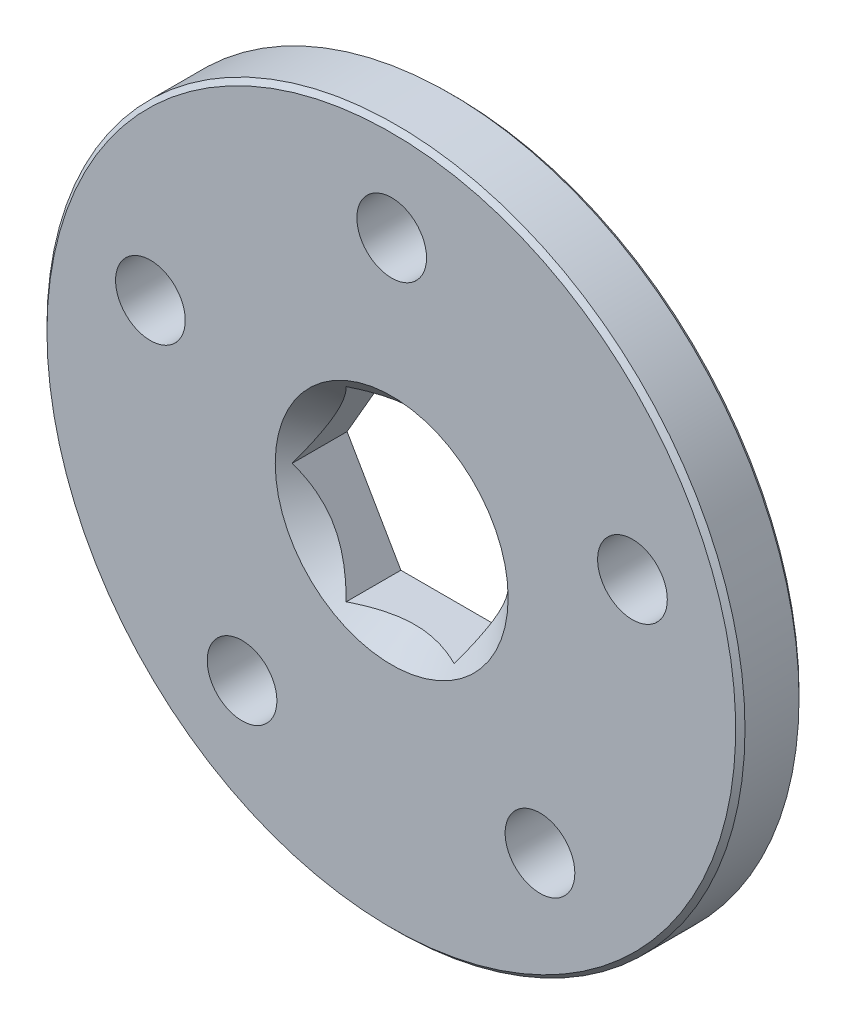
ISO-10303-21;
HEADER;
FILE_DESCRIPTION(('STEP AP214'),'2;1');
FILE_NAME('part.step','',(''),(''),'','','');
FILE_SCHEMA(('AUTOMOTIVE_DESIGN { 1 0 10303 214 1 1 1 1 }'));
ENDSEC;
DATA;
#1=APPLICATION_CONTEXT('core data for automotive mechanical design processes');
#2=APPLICATION_PROTOCOL_DEFINITION('international standard','automotive_design',2000,#1);
#3=PRODUCT_CONTEXT('',#1,'mechanical');
#4=PRODUCT('Part','Part','',(#3));
#5=PRODUCT_RELATED_PRODUCT_CATEGORY('part','',(#4));
#6=PRODUCT_DEFINITION_FORMATION('','',#4);
#7=PRODUCT_DEFINITION_CONTEXT('part definition',#1,'design');
#8=PRODUCT_DEFINITION('design','',#6,#7);
#9=PRODUCT_DEFINITION_SHAPE('','',#8);
#10=(LENGTH_UNIT() NAMED_UNIT(*) SI_UNIT(.MILLI.,.METRE.));
#11=(NAMED_UNIT(*) PLANE_ANGLE_UNIT() SI_UNIT($,.RADIAN.));
#12=(NAMED_UNIT(*) SI_UNIT($,.STERADIAN.) SOLID_ANGLE_UNIT());
#13=UNCERTAINTY_MEASURE_WITH_UNIT(LENGTH_MEASURE(1.E-05),#10,'distance_accuracy_value','');
#14=(GEOMETRIC_REPRESENTATION_CONTEXT(3) GLOBAL_UNCERTAINTY_ASSIGNED_CONTEXT((#13)) GLOBAL_UNIT_ASSIGNED_CONTEXT((#10,
#11,#12)) REPRESENTATION_CONTEXT('',''));
#15=CARTESIAN_POINT('',(0.,0.,0.));
#16=DIRECTION('',(0.,0.,1.));
#17=DIRECTION('',(1.,0.,0.));
#18=AXIS2_PLACEMENT_3D('',#15,#16,#17);
#19=CARTESIAN_POINT('',(0.,0.,4.0005));
#20=DIRECTION('',(0.,0.,-1.));
#21=DIRECTION('',(-1.,0.,0.));
#22=AXIS2_PLACEMENT_3D('',#19,#20,#21);
#23=CONICAL_SURFACE('',#22,23.7871,0.785398163397448);
#24=CARTESIAN_POINT('',(0.,0.,4.0005));
#25=DIRECTION('',(0.,0.,1.));
#26=DIRECTION('',(1.,0.,0.));
#27=AXIS2_PLACEMENT_3D('',#24,#25,#26);
#28=CIRCLE('',#27,23.7871);
#29=CARTESIAN_POINT('',(23.7871,0.,4.0005));
#30=VERTEX_POINT('',#29);
#31=EDGE_CURVE('E119',#30,#30,#28,.F.);
#32=ORIENTED_EDGE('',*,*,#31,.F.);
#33=EDGE_LOOP('',(#32));
#34=FACE_BOUND('',#33,.T.);
#35=CARTESIAN_POINT('',(0.,0.,4.318));
#36=DIRECTION('',(0.,0.,-1.));
#37=DIRECTION('',(-1.,0.,0.));
#38=AXIS2_PLACEMENT_3D('',#35,#36,#37);
#39=CIRCLE('',#38,23.4696);
#40=CARTESIAN_POINT('',(-23.4696,0.,4.318));
#41=VERTEX_POINT('',#40);
#42=EDGE_CURVE('E20',#41,#41,#39,.F.);
#43=ORIENTED_EDGE('',*,*,#42,.F.);
#44=EDGE_LOOP('',(#43));
#45=FACE_BOUND('',#44,.T.);
#46=ADVANCED_FACE('F17',(#34,#45),#23,.T.);
#47=CARTESIAN_POINT('',(0.,0.,0.));
#48=DIRECTION('',(0.,0.,1.));
#49=DIRECTION('',(1.,0.,0.));
#50=AXIS2_PLACEMENT_3D('',#47,#48,#49);
#51=CYLINDRICAL_SURFACE('',#50,23.7871);
#52=ORIENTED_EDGE('',*,*,#31,.T.);
#53=EDGE_LOOP('',(#52));
#54=FACE_BOUND('',#53,.T.);
#55=CARTESIAN_POINT('',(0.,0.,0.317500000000002));
#56=DIRECTION('',(0.,0.,1.));
#57=DIRECTION('',(1.,0.,0.));
#58=AXIS2_PLACEMENT_3D('',#55,#56,#57);
#59=CIRCLE('',#58,23.7871);
#60=CARTESIAN_POINT('',(23.7871,0.,0.317500000000001));
#61=VERTEX_POINT('',#60);
#62=EDGE_CURVE('E114',#61,#61,#59,.F.);
#63=ORIENTED_EDGE('',*,*,#62,.F.);
#64=EDGE_LOOP('',(#63));
#65=FACE_BOUND('',#64,.T.);
#66=ADVANCED_FACE('F300',(#54,#65),#51,.T.);
#67=CARTESIAN_POINT('',(0.,0.,4.318));
#68=DIRECTION('',(0.,0.,1.));
#69=DIRECTION('',(1.,0.,0.));
#70=AXIS2_PLACEMENT_3D('',#67,#68,#69);
#71=PLANE('',#70);
#72=CARTESIAN_POINT('',(0.0254000000000018,0.,4.318));
#73=DIRECTION('',(0.,0.,1.));
#74=DIRECTION('',(1.,0.,0.));
#75=AXIS2_PLACEMENT_3D('',#72,#73,#74);
#76=CIRCLE('',#75,7.9375);
#77=CARTESIAN_POINT('',(7.96290000000001,0.,4.318));
#78=VERTEX_POINT('',#77);
#79=EDGE_CURVE('E118',#78,#78,#76,.F.);
#80=ORIENTED_EDGE('',*,*,#79,.T.);
#81=EDGE_LOOP('',(#80));
#82=FACE_BOUND('',#81,.T.);
#83=CARTESIAN_POINT('',(0.0254000000000021,17.272,4.318));
#84=DIRECTION('',(0.,0.,1.));
#85=DIRECTION('',(1.,0.,0.));
#86=AXIS2_PLACEMENT_3D('',#83,#84,#85);
#87=CIRCLE('',#86,2.3749);
#88=CARTESIAN_POINT('',(2.4003,17.272,4.318));
#89=VERTEX_POINT('',#88);
#90=EDGE_CURVE('E340',#89,#89,#87,.F.);
#91=ORIENTED_EDGE('',*,*,#90,.T.);
#92=EDGE_LOOP('',(#91));
#93=FACE_BOUND('',#92,.T.);
#94=CARTESIAN_POINT('',(-16.4187991177928,5.36149836235799,4.318));
#95=DIRECTION('',(0.,0.,1.));
#96=DIRECTION('',(1.,0.,0.));
#97=AXIS2_PLACEMENT_3D('',#94,#95,#96);
#98=CIRCLE('',#97,2.3749);
#99=CARTESIAN_POINT('',(-14.0438991177928,5.36149836235799,4.318));
#100=VERTEX_POINT('',#99);
#101=EDGE_CURVE('E338',#100,#100,#98,.F.);
#102=ORIENTED_EDGE('',*,*,#101,.T.);
#103=EDGE_LOOP('',(#102));
#104=FACE_BOUND('',#103,.T.);
#105=CARTESIAN_POINT('',(-10.1727759092527,-13.9584117814359,4.318));
#106=DIRECTION('',(0.,0.,1.));
#107=DIRECTION('',(1.,0.,0.));
#108=AXIS2_PLACEMENT_3D('',#105,#106,#107);
#109=CIRCLE('',#108,2.3749);
#110=CARTESIAN_POINT('',(-7.79787590925272,-13.9584117814359,4.318));
#111=VERTEX_POINT('',#110);
#112=EDGE_CURVE('E335',#111,#111,#109,.F.);
#113=ORIENTED_EDGE('',*,*,#112,.T.);
#114=EDGE_LOOP('',(#113));
#115=FACE_BOUND('',#114,.T.);
#116=CARTESIAN_POINT('',(10.1316778459385,-13.9882712722523,4.318));
#117=DIRECTION('',(0.,0.,1.));
#118=DIRECTION('',(1.,0.,0.));
#119=AXIS2_PLACEMENT_3D('',#116,#117,#118);
#120=CIRCLE('',#119,2.3749);
#121=CARTESIAN_POINT('',(12.5065778459385,-13.9882712722523,4.318));
#122=VERTEX_POINT('',#121);
#123=EDGE_CURVE('E332',#122,#122,#120,.F.);
#124=ORIENTED_EDGE('',*,*,#123,.T.);
#125=EDGE_LOOP('',(#124));
#126=FACE_BOUND('',#125,.T.);
#127=CARTESIAN_POINT('',(16.434497181107,5.31318469133019,4.318));
#128=DIRECTION('',(0.,0.,1.));
#129=DIRECTION('',(1.,0.,0.));
#130=AXIS2_PLACEMENT_3D('',#127,#128,#129);
#131=CIRCLE('',#130,2.3749);
#132=CARTESIAN_POINT('',(18.809397181107,5.31318469133019,4.318));
#133=VERTEX_POINT('',#132);
#134=EDGE_CURVE('E117',#133,#133,#131,.F.);
#135=ORIENTED_EDGE('',*,*,#134,.T.);
#136=EDGE_LOOP('',(#135));
#137=FACE_BOUND('',#136,.T.);
#138=ORIENTED_EDGE('',*,*,#42,.T.);
#139=EDGE_LOOP('',(#138));
#140=FACE_BOUND('',#139,.T.);
#141=ADVANCED_FACE('F225',(#82,#93,#104,#115,#126,#137,#140),#71,.T.);
#142=CARTESIAN_POINT('',(0.0254000000000018,0.,4.318));
#143=DIRECTION('',(0.,0.,1.));
#144=DIRECTION('',(1.,0.,0.));
#145=AXIS2_PLACEMENT_3D('',#142,#143,#144);
#146=CONICAL_SURFACE('',#145,7.9375,0.785398163397448);
#147=CARTESIAN_POINT('',(7.33234841870825,0.,3.68744841870824));
#148=CARTESIAN_POINT('',(7.26952756963413,0.108808902370995,3.62463700166614));
#149=CARTESIAN_POINT('',(7.20622382887179,0.218454197680537,3.56375345476514));
#150=CARTESIAN_POINT('',(7.07855582285768,0.43958167059798,3.44642855314309));
#151=CARTESIAN_POINT('',(7.01419100110241,0.551064812098225,3.38998962531908));
#152=CARTESIAN_POINT('',(6.8187651251393,0.889552358379975,3.22773840807958));
#153=CARTESIAN_POINT('',(6.68604964753109,1.11942230854818,3.12968362555372));
#154=CARTESIAN_POINT('',(6.41844100724842,1.58293407006217,2.96179064688042));
#155=CARTESIAN_POINT('',(6.28361695982751,1.81645617027727,2.89152492882045));
#156=CARTESIAN_POINT('',(6.07916487464507,2.17057756952666,2.81024475342657));
#157=CARTESIAN_POINT('',(6.01071322802986,2.28913929932595,2.78718195995303));
#158=CARTESIAN_POINT('',(5.87323049917661,2.52726637086299,2.74961758628473));
#159=CARTESIAN_POINT('',(5.80419950504106,2.64683156000275,2.73511472746037));
#160=CARTESIAN_POINT('',(5.63597014577435,2.93821335757745,2.71079667773526));
#161=CARTESIAN_POINT('',(5.53659049726747,3.1103439580297,2.70569452329679));
#162=CARTESIAN_POINT('',(5.33801041760491,3.45429474537633,2.71426070717162));
#163=CARTESIAN_POINT('',(5.2388100612999,3.62611480262555,2.7279356120531));
#164=CARTESIAN_POINT('',(5.041336109326,3.96814972061575,2.77325185197295));
#165=CARTESIAN_POINT('',(4.94306377323687,4.13836239970061,2.80491479811632));
#166=CARTESIAN_POINT('',(4.74820821624311,4.47586212455093,2.88448666291767));
#167=CARTESIAN_POINT('',(4.65162487004765,4.6431493873265,2.93239437110217));
#168=CARTESIAN_POINT('',(4.47904516286503,4.94206620852214,3.03160341384285));
#169=CARTESIAN_POINT('',(4.40268866303939,5.07431954570828,3.08044498983715));
#170=CARTESIAN_POINT('',(4.25136665744274,5.3364169477049,3.18608855918441));
#171=CARTESIAN_POINT('',(4.17640121714007,5.46626089912089,3.24289092613061));
#172=CARTESIAN_POINT('',(4.02810106364341,5.72312429974737,3.36315157963862));
#173=CARTESIAN_POINT('',(3.95476199528457,5.85015129232466,3.42658856463511));
#174=CARTESIAN_POINT('',(3.8094622055523,6.10181791047002,3.55926576234678));
#175=CARTESIAN_POINT('',(3.73750062129661,6.22645903059402,3.62850218559949));
#176=CARTESIAN_POINT('',(3.66617420935412,6.35,3.70018147145066));
#177=B_SPLINE_CURVE_WITH_KNOTS('',3,(#147,#148,#149,#150,#151,#152,#153,#154,#155,#156,#157,
#158,#159,#160,#161,#162,#163,#164,#165,#166,#167,#168,#169,#170,#171,#172,#173,#174,#175,#176),
.UNSPECIFIED.,.F.,.F.,(4,2,2,2,2,2,2,2,2,2,2,2,2,2,4),(0.,0.421377740717376,0.842983993745287,
1.69074664951461,2.52490593203209,2.94116786853566,3.35736761068304,3.95291520290179,
4.54867111847809,5.14514430246598,5.74157305020081,6.22233965410499,6.70312882754224,
7.18241916235569,7.66139872700396),.UNSPECIFIED.);
#178=CARTESIAN_POINT('',(7.33234841870825,0.,3.68744841870824));
#179=VERTEX_POINT('',#178);
#180=CARTESIAN_POINT('',(3.66617420935412,6.35,3.70018147145066));
#181=VERTEX_POINT('',#180);
#182=EDGE_CURVE('E88',#179,#181,#177,.T.);
#183=ORIENTED_EDGE('',*,*,#182,.F.);
#184=CARTESIAN_POINT('',(3.66617420935413,-6.35,3.70018147145066));
#185=CARTESIAN_POINT('',(3.72936938756821,-6.24054274053984,3.63666733502622));
#186=CARTESIAN_POINT('',(3.79305213395065,-6.13024098823993,3.57508951091755));
#187=CARTESIAN_POINT('',(3.9214902785803,-5.9077795961115,3.4564005759142));
#188=CARTESIAN_POINT('',(3.98624624602277,-5.79561897040786,3.39929193355931));
#189=CARTESIAN_POINT('',(4.18288584833023,-5.4550291884312,3.23506226373363));
#190=CARTESIAN_POINT('',(4.31644530252405,-5.22369742793634,3.13575252285753));
#191=CARTESIAN_POINT('',(4.58581036963342,-4.7571434459187,2.96561578066456));
#192=CARTESIAN_POINT('',(4.72154605552913,-4.52204234154713,2.89435926625479));
#193=CARTESIAN_POINT('',(4.92740940832738,-4.16547655508409,2.81189160762044));
#194=CARTESIAN_POINT('',(4.99633667503958,-4.0460910271117,2.78848322556337));
#195=CARTESIAN_POINT('',(5.13478318056803,-3.80629464540605,2.75034167299294));
#196=CARTESIAN_POINT('',(5.20430232660841,-3.68588395236532,2.73560716737026));
#197=CARTESIAN_POINT('',(5.37306720456173,-3.39357460921701,2.71097575896967));
#198=CARTESIAN_POINT('',(5.47249353357099,-3.22136315576291,2.70573461384712));
#199=CARTESIAN_POINT('',(5.67117368940915,-2.87723903139552,2.71404304593527));
#200=CARTESIAN_POINT('',(5.77042744261428,-2.70532648800233,2.72759928332228));
#201=CARTESIAN_POINT('',(5.9679979484599,-2.36312433380063,2.77270136170767));
#202=CARTESIAN_POINT('',(6.06631359497643,-2.19283663885502,2.80426627808232));
#203=CARTESIAN_POINT('',(6.26125754981137,-1.85518380445248,2.88366604380315));
#204=CARTESIAN_POINT('',(6.35788598845896,-1.68781843925881,2.93149963057046));
#205=CARTESIAN_POINT('',(6.52951402562612,-1.39054995888198,3.03000261190955));
#206=CARTESIAN_POINT('',(6.6048916861307,-1.25999202113236,3.07808665420995));
#207=CARTESIAN_POINT('',(6.75429213429584,-1.00122285423677,3.18203082151573));
#208=CARTESIAN_POINT('',(6.82831487799429,-0.873011701235412,3.23789119833053));
#209=CARTESIAN_POINT('',(6.9747780932519,-0.619329970969332,3.35613614976592));
#210=CARTESIAN_POINT('',(7.04722262222051,-0.493852366065297,3.41850078867799));
#211=CARTESIAN_POINT('',(7.19076753003381,-0.245225292564874,3.54892733770682));
#212=CARTESIAN_POINT('',(7.2618687075826,-0.1220744405724,3.61698572293449));
#213=CARTESIAN_POINT('',(7.33234841870825,0.,3.68744841870824));
#214=B_SPLINE_CURVE_WITH_KNOTS('',3,(#184,#185,#186,#187,#188,#189,#190,#191,#192,#193,#194,
#195,#196,#197,#198,#199,#200,#201,#202,#203,#204,#205,#206,#207,#208,#209,#210,#211,#212,#213),
.UNSPECIFIED.,.F.,.F.,(4,2,2,2,2,2,2,2,2,2,2,2,2,2,4),(0.,0.424330209545031,0.848893166247984,
1.70270136976581,2.54287520795019,2.96211927023583,3.38129878432157,3.97713678108649,
4.57318594556533,5.1698676399138,5.76650303755553,6.24099292787436,6.71549818646646,
7.188589589855,7.66139024855428),.UNSPECIFIED.);
#215=CARTESIAN_POINT('',(3.66617420935413,-6.35,3.70018147145066));
#216=VERTEX_POINT('',#215);
#217=EDGE_CURVE('E144',#216,#179,#214,.T.);
#218=ORIENTED_EDGE('',*,*,#217,.F.);
#219=CARTESIAN_POINT('',(-3.66617420935412,-6.35,3.72558135715109));
#220=CARTESIAN_POINT('',(-3.53935814549086,-6.35,3.66185442683294));
#221=CARTESIAN_POINT('',(-3.41156375161872,-6.35,3.60007017551734));
#222=CARTESIAN_POINT('',(-3.15382269462983,-6.35,3.48098300367112));
#223=CARTESIAN_POINT('',(-3.02387488995422,-6.35,3.42368255857721));
#224=CARTESIAN_POINT('',(-2.62927240000761,-6.35,3.25890046813562));
#225=CARTESIAN_POINT('',(-2.36125519920184,-6.35,3.15925554655604));
#226=CARTESIAN_POINT('',(-1.82066746806708,-6.35,2.98852583919459));
#227=CARTESIAN_POINT('',(-1.54823575575753,-6.35,2.91701474185388));
#228=CARTESIAN_POINT('',(-1.13505219518423,-6.35,2.83425301024454));
#229=CARTESIAN_POINT('',(-0.996709842049376,-6.35,2.81076127920668));
#230=CARTESIAN_POINT('',(-0.718836913584857,-6.35,2.77248426741899));
#231=CARTESIAN_POINT('',(-0.579306524525461,-6.35,2.75769764641084));
#232=CARTESIAN_POINT('',(-0.240586519894273,-6.35,2.73298017503945));
#233=CARTESIAN_POINT('',(-0.0410344537725965,-6.35,2.72772145165099));
#234=CARTESIAN_POINT('',(0.357723493109547,-6.35,2.73606158817779));
#235=CARTESIAN_POINT('',(0.55692922578237,-6.35,2.74966714487149));
#236=CARTESIAN_POINT('',(0.953443002122463,-6.35,2.79492980619961));
#237=CARTESIAN_POINT('',(1.15074900203101,-6.35,2.82660453081173));
#238=CARTESIAN_POINT('',(1.5419747709315,-6.35,2.90627895717809));
#239=CARTESIAN_POINT('',(1.73589480910472,-6.35,2.95427735494356));
#240=CARTESIAN_POINT('',(2.07805309701056,-6.35,3.05246581997752));
#241=CARTESIAN_POINT('',(2.22708894412207,-6.35,3.0999297732567));
#242=CARTESIAN_POINT('',(2.52252169969469,-6.35,3.2024446571866));
#243=CARTESIAN_POINT('',(2.6689185657494,-6.35,3.25749570963345));
#244=CARTESIAN_POINT('',(2.95863037704002,-6.35,3.37398116572405));
#245=CARTESIAN_POINT('',(3.10195309377019,-6.35,3.43539639876086));
#246=CARTESIAN_POINT('',(3.38597938398834,-6.35,3.56381537293284));
#247=CARTESIAN_POINT('',(3.52668441830453,-6.35,3.63081587528143));
#248=CARTESIAN_POINT('',(3.66617420935413,-6.35,3.70018147145066));
#249=B_SPLINE_CURVE_WITH_KNOTS('',3,(#219,#220,#221,#222,#223,#224,#225,#226,#227,#228,#229,
#230,#231,#232,#233,#234,#235,#236,#237,#238,#239,#240,#241,#242,#243,#244,#245,#246,#247,#248),
.UNSPECIFIED.,.F.,.F.,(4,2,2,2,2,2,2,2,2,2,2,2,2,2,4),(0.,0.425757923533551,0.851749266613398,
1.7084303682965,2.55157804014613,2.97230589521757,3.39296895713,3.99090252383276,
4.58904841000859,5.18777857196359,5.78646091661178,6.25548099496867,6.7245086034089,
7.19216232604477,7.65954672725261),.UNSPECIFIED.);
#250=CARTESIAN_POINT('',(-3.66617420935412,-6.35,3.72558135715109));
#251=VERTEX_POINT('',#250);
#252=EDGE_CURVE('E169',#251,#216,#249,.T.);
#253=ORIENTED_EDGE('',*,*,#252,.F.);
#254=CARTESIAN_POINT('',(-7.33234841870825,0.,3.73824841870825));
#255=CARTESIAN_POINT('',(-7.26910167255825,-0.109546577745214,3.67501115978067));
#256=CARTESIAN_POINT('',(-7.20536883778381,-0.219935085684926,3.61371451442266));
#257=CARTESIAN_POINT('',(-7.07683566866682,-0.4425610650534,3.49559267827345));
#258=CARTESIAN_POINT('',(-7.01203477462787,-0.554799505904746,3.43876992826307));
#259=CARTESIAN_POINT('',(-6.81528498716017,-0.895580134177182,3.27541327346387));
#260=CARTESIAN_POINT('',(-6.68167077744168,-1.12700673402277,3.1766878068715));
#261=CARTESIAN_POINT('',(-6.41220439029477,-1.59373620749324,3.00760920197667));
#262=CARTESIAN_POINT('',(-6.27642033181324,-1.82892109564116,2.93683476330989));
#263=CARTESIAN_POINT('',(-6.07051191054191,-2.18556494298939,2.85496696350207));
#264=CARTESIAN_POINT('',(-6.0015726200013,-2.30497129684348,2.83173762121835));
#265=CARTESIAN_POINT('',(-5.86311033225964,-2.54479501414426,2.79390257016915));
#266=CARTESIAN_POINT('',(-5.79358742387471,-2.66521222375692,2.77929557253053));
#267=CARTESIAN_POINT('',(-5.62416798526401,-2.95865529922045,2.75480549261933));
#268=CARTESIAN_POINT('',(-5.52408891436029,-3.13199733479997,2.74966822146503));
#269=CARTESIAN_POINT('',(-5.32411117602727,-3.47836893797547,2.75829789624562));
#270=CARTESIAN_POINT('',(-5.22421258429293,-3.65139837446394,2.77207148147448));
#271=CARTESIAN_POINT('',(-5.02536585763175,-3.99581100795987,2.81770894758329));
#272=CARTESIAN_POINT('',(-4.92641881298517,-4.16719231654653,2.84959153004102));
#273=CARTESIAN_POINT('',(-4.7302253868464,-4.50700929872988,2.92971275888723));
#274=CARTESIAN_POINT('',(-4.63297887168434,-4.6754452038496,2.97795011357866));
#275=CARTESIAN_POINT('',(-4.46149816968867,-4.97245849222367,3.07652735981382));
#276=CARTESIAN_POINT('',(-4.38686210903872,-5.10173194134617,3.12412450471101));
#277=CARTESIAN_POINT('',(-4.23890967519568,-5.35799307386578,3.22689923771946));
#278=CARTESIAN_POINT('',(-4.16559332044857,-5.48498072531353,3.28207693169368));
#279=CARTESIAN_POINT('',(-4.02050775287851,-5.73627629978984,3.39880627502029));
#280=CARTESIAN_POINT('',(-3.94873454475084,-5.86059114288918,3.46033822271047));
#281=CARTESIAN_POINT('',(-3.80649696616385,-6.10695385574742,3.5889878221388));
#282=CARTESIAN_POINT('',(-3.73603187242883,-6.22900297825657,3.65610226746482));
#283=CARTESIAN_POINT('',(-3.66617420935412,-6.35,3.72558135715109));
#284=B_SPLINE_CURVE_WITH_KNOTS('',3,(#254,#255,#256,#257,#258,#259,#260,#261,#262,#263,#264,
#265,#266,#267,#268,#269,#270,#271,#272,#273,#274,#275,#276,#277,#278,#279,#280,#281,#282,#283),
.UNSPECIFIED.,.F.,.F.,(4,2,2,2,2,2,2,2,2,2,2,2,2,2,4),(0.,0.424234532913959,0.848698930426519,
1.70221014457027,2.54231482748918,2.96154323151679,3.38070895315649,3.98044776967939,
4.58039719859214,5.18096733854177,5.78149005661155,6.25130763853487,6.72113178216432,
7.18954062431539,7.65768226065954),.UNSPECIFIED.);
#285=CARTESIAN_POINT('',(-7.33234841870825,0.,3.73824841870825));
#286=VERTEX_POINT('',#285);
#287=EDGE_CURVE('E176',#286,#251,#284,.T.);
#288=ORIENTED_EDGE('',*,*,#287,.F.);
#289=CARTESIAN_POINT('',(-3.66617420935413,6.35,3.72558135715109));
#290=CARTESIAN_POINT('',(-3.72905126076744,6.24109375232202,3.66303996827601));
#291=CARTESIAN_POINT('',(-3.79240977306407,6.13135358993227,3.60243090525662));
#292=CARTESIAN_POINT('',(-3.92018231915139,5.91004504829661,3.48566014309342));
#293=CARTESIAN_POINT('',(-3.98459690026477,5.79847572105996,3.42950084407947));
#294=CARTESIAN_POINT('',(-4.18014825473498,5.45977083962865,3.26810412525014));
#295=CARTESIAN_POINT('',(-4.31292923746256,5.22978743126555,3.17062234024389));
#296=CARTESIAN_POINT('',(-4.58066088609692,4.76606261303667,3.003770524624));
#297=CARTESIAN_POINT('',(-4.7155441958657,4.53243786742409,2.93398094803238));
#298=CARTESIAN_POINT('',(-4.92005822588296,4.17820917657353,2.85329747620772));
#299=CARTESIAN_POINT('',(-4.98852755157522,4.05961682571455,2.83041363987131));
#300=CARTESIAN_POINT('',(-5.12603749918783,3.82144260990337,2.79315781533549));
#301=CARTESIAN_POINT('',(-5.19507803677735,3.70186089101646,2.7787845926322));
#302=CARTESIAN_POINT('',(-5.36397096313801,3.4093297615208,2.75461859964364));
#303=CARTESIAN_POINT('',(-5.46400642533622,3.23606325843487,2.74962842401213));
#304=CARTESIAN_POINT('',(-5.6638898399133,2.88985502879701,2.75853302582071));
#305=CARTESIAN_POINT('',(-5.76373771523495,2.7169134357121,2.77243435298115));
#306=CARTESIAN_POINT('',(-5.96249282687835,2.37265948408172,2.81830456833418));
#307=CARTESIAN_POINT('',(-6.06139881850531,2.20134928141084,2.85029469113709));
#308=CARTESIAN_POINT('',(-6.25750801921065,1.86167818195746,2.93060697603247));
#309=CARTESIAN_POINT('',(-6.35471135685784,1.69331706248726,2.9789278993321));
#310=CARTESIAN_POINT('',(-6.52713026272196,1.39467875734517,3.07821801018172));
#311=CARTESIAN_POINT('',(-6.60273038967714,1.26373549640015,3.12656621653151));
#312=CARTESIAN_POINT('',(-6.7525758938087,1.00419546995851,3.23102146388728));
#313=CARTESIAN_POINT('',(-6.8268212333787,0.875598769598067,3.28712871990033));
#314=CARTESIAN_POINT('',(-6.97371751796516,0.621166941251213,3.40584503707926));
#315=CARTESIAN_POINT('',(-7.04637274807538,0.495324391264702,3.4684330641793));
#316=CARTESIAN_POINT('',(-7.19034120864048,0.24596370287847,3.59929832395226));
#317=CARTESIAN_POINT('',(-7.26165522130901,0.122444209644972,3.6675721060066));
#318=CARTESIAN_POINT('',(-7.33234841870825,0.,3.73824841870825));
#319=B_SPLINE_CURVE_WITH_KNOTS('',3,(#289,#290,#291,#292,#293,#294,#295,#296,#297,#298,#299,
#300,#301,#302,#303,#304,#305,#306,#307,#308,#309,#310,#311,#312,#313,#314,#315,#316,#317,#318),
.UNSPECIFIED.,.F.,.F.,(4,2,2,2,2,2,2,2,2,2,2,2,2,2,4),(0.,0.421317945679588,0.842861617879262,
1.69040291466245,2.52456268770696,2.94084306898501,3.35706305206639,3.9565294742475,
4.55620378562245,5.15658352625344,5.75691773456378,6.23292215980741,6.70893977801119,
7.18345817296456,7.65769065804257),.UNSPECIFIED.);
#320=CARTESIAN_POINT('',(-3.66617420935413,6.35,3.72558135715109));
#321=VERTEX_POINT('',#320);
#322=EDGE_CURVE('E182',#321,#286,#319,.T.);
#323=ORIENTED_EDGE('',*,*,#322,.F.);
#324=CARTESIAN_POINT('',(3.66617420935412,6.35,3.70018147145066));
#325=CARTESIAN_POINT('',(3.54084615752562,6.35,3.63785310423772));
#326=CARTESIAN_POINT('',(3.41455838371141,6.35,3.57745068685137));
#327=CARTESIAN_POINT('',(3.15987877645137,6.35,3.46107857290351));
#328=CARTESIAN_POINT('',(3.03148585157411,6.35,3.40511126949086));
#329=CARTESIAN_POINT('',(2.64170756213481,6.35,3.24426749740126));
#330=CARTESIAN_POINT('',(2.37704468539213,6.35,3.1471211732012));
#331=CARTESIAN_POINT('',(1.84343913249125,6.35,2.98086196558124));
#332=CARTESIAN_POINT('',(1.57463212661774,6.35,2.91132651297173));
#333=CARTESIAN_POINT('',(1.16705977940493,6.35,2.83093658674152));
#334=CARTESIAN_POINT('',(1.03060856130771,6.35,2.80813595077067));
#335=CARTESIAN_POINT('',(0.756567795920429,6.35,2.77101535319071));
#336=CARTESIAN_POINT('',(0.618978416584574,6.35,2.75669416216479));
#337=CARTESIAN_POINT('',(0.282382416302,6.35,2.73261417360306));
#338=CARTESIAN_POINT('',(0.0830109077724311,6.35,2.72764156401335));
#339=CARTESIAN_POINT('',(-0.315358278188982,6.35,2.73651443790745));
#340=CARTESIAN_POINT('',(-0.514355802354398,6.35,2.75036643499239));
#341=CARTESIAN_POINT('',(-0.910493275100637,6.35,2.79607607132486));
#342=CARTESIAN_POINT('',(-1.10763056409899,6.35,2.82795639936929));
#343=CARTESIAN_POINT('',(-1.49851111624918,6.35,2.90799404740528));
#344=CARTESIAN_POINT('',(-1.69225462829714,6.35,2.95615016844538));
#345=CARTESIAN_POINT('',(-2.03819255062116,6.35,3.05575767776307));
#346=CARTESIAN_POINT('',(-2.19111408967848,6.35,3.10473026182018));
#347=CARTESIAN_POINT('',(-2.49417588258302,6.35,3.21062506126328));
#348=CARTESIAN_POINT('',(-2.64431601278981,6.35,3.26754762908967));
#349=CARTESIAN_POINT('',(-2.94132295028538,6.35,3.38803563749943));
#350=CARTESIAN_POINT('',(-3.08819870441616,6.35,3.45157920877171));
#351=CARTESIAN_POINT('',(-3.37919637687068,6.35,3.5844642943525));
#352=CARTESIAN_POINT('',(-3.52332000204233,6.35,3.65380206151544));
#353=CARTESIAN_POINT('',(-3.66617420935413,6.35,3.72558135715109));
#354=B_SPLINE_CURVE_WITH_KNOTS('',3,(#324,#325,#326,#327,#328,#329,#330,#331,#332,#333,#334,
#335,#336,#337,#338,#339,#340,#341,#342,#343,#344,#345,#346,#347,#348,#349,#350,#351,#352,#353),
.UNSPECIFIED.,.F.,.F.,(4,2,2,2,2,2,2,2,2,2,2,2,2,2,4),(0.,0.419889005052411,0.840003057272229,
1.68466898300243,2.51585740317886,2.93065521455602,3.34539287053897,3.94276369939684,
4.54034128031343,5.13867259638313,5.73695984615681,6.2184431906998,6.69994788724645,
7.17990976018625,7.65956360570573),.UNSPECIFIED.);
#355=EDGE_CURVE('E67',#181,#321,#354,.T.);
#356=ORIENTED_EDGE('',*,*,#355,.F.);
#357=EDGE_LOOP('',(#183,#218,#253,#288,#323,#356));
#358=FACE_BOUND('',#357,.T.);
#359=ORIENTED_EDGE('',*,*,#79,.F.);
#360=EDGE_LOOP('',(#359));
#361=FACE_BOUND('',#360,.T.);
#362=ADVANCED_FACE('F150',(#358,#361),#146,.F.);
#363=CARTESIAN_POINT('',(0.,0.,0.317500000000001));
#364=DIRECTION('',(0.,0.,1.));
#365=DIRECTION('',(1.,0.,0.));
#366=AXIS2_PLACEMENT_3D('',#363,#364,#365);
#367=CONICAL_SURFACE('',#366,23.7871,0.785398163397451);
#368=ORIENTED_EDGE('',*,*,#62,.T.);
#369=EDGE_LOOP('',(#368));
#370=FACE_BOUND('',#369,.T.);
#371=CARTESIAN_POINT('',(0.,0.,0.));
#372=DIRECTION('',(0.,0.,1.));
#373=DIRECTION('',(1.,0.,0.));
#374=AXIS2_PLACEMENT_3D('',#371,#372,#373);
#375=CIRCLE('',#374,23.4696);
#376=CARTESIAN_POINT('',(23.4696,0.,0.));
#377=VERTEX_POINT('',#376);
#378=EDGE_CURVE('E89',#377,#377,#375,.F.);
#379=ORIENTED_EDGE('',*,*,#378,.F.);
#380=EDGE_LOOP('',(#379));
#381=FACE_BOUND('',#380,.T.);
#382=ADVANCED_FACE('F217',(#370,#381),#367,.T.);
#383=CARTESIAN_POINT('',(16.434497181107,5.31318469133019,-5.207));
#384=DIRECTION('',(0.,0.,1.));
#385=DIRECTION('',(1.,0.,0.));
#386=AXIS2_PLACEMENT_3D('',#383,#384,#385);
#387=CYLINDRICAL_SURFACE('',#386,2.3749);
#388=ORIENTED_EDGE('',*,*,#134,.F.);
#389=EDGE_LOOP('',(#388));
#390=FACE_BOUND('',#389,.T.);
#391=CARTESIAN_POINT('',(16.434497181107,5.31318469133019,0.));
#392=DIRECTION('',(0.,0.,1.));
#393=DIRECTION('',(1.,0.,0.));
#394=AXIS2_PLACEMENT_3D('',#391,#392,#393);
#395=CIRCLE('',#394,2.3749);
#396=CARTESIAN_POINT('',(18.809397181107,5.31318469133019,0.));
#397=VERTEX_POINT('',#396);
#398=EDGE_CURVE('E133',#397,#397,#395,.T.);
#399=ORIENTED_EDGE('',*,*,#398,.F.);
#400=EDGE_LOOP('',(#399));
#401=FACE_BOUND('',#400,.T.);
#402=ADVANCED_FACE('F214',(#390,#401),#387,.F.);
#403=CARTESIAN_POINT('',(10.1316778459385,-13.9882712722523,-5.207));
#404=DIRECTION('',(0.,0.,1.));
#405=DIRECTION('',(1.,0.,0.));
#406=AXIS2_PLACEMENT_3D('',#403,#404,#405);
#407=CYLINDRICAL_SURFACE('',#406,2.3749);
#408=ORIENTED_EDGE('',*,*,#123,.F.);
#409=EDGE_LOOP('',(#408));
#410=FACE_BOUND('',#409,.T.);
#411=CARTESIAN_POINT('',(10.1316778459385,-13.9882712722523,0.));
#412=DIRECTION('',(0.,0.,1.));
#413=DIRECTION('',(1.,0.,0.));
#414=AXIS2_PLACEMENT_3D('',#411,#412,#413);
#415=CIRCLE('',#414,2.3749);
#416=CARTESIAN_POINT('',(12.5065778459385,-13.9882712722523,0.));
#417=VERTEX_POINT('',#416);
#418=EDGE_CURVE('E130',#417,#417,#415,.T.);
#419=ORIENTED_EDGE('',*,*,#418,.F.);
#420=EDGE_LOOP('',(#419));
#421=FACE_BOUND('',#420,.T.);
#422=ADVANCED_FACE('F210',(#410,#421),#407,.F.);
#423=CARTESIAN_POINT('',(-10.1727759092527,-13.9584117814359,-5.207));
#424=DIRECTION('',(0.,0.,1.));
#425=DIRECTION('',(1.,0.,0.));
#426=AXIS2_PLACEMENT_3D('',#423,#424,#425);
#427=CYLINDRICAL_SURFACE('',#426,2.3749);
#428=ORIENTED_EDGE('',*,*,#112,.F.);
#429=EDGE_LOOP('',(#428));
#430=FACE_BOUND('',#429,.T.);
#431=CARTESIAN_POINT('',(-10.1727759092527,-13.9584117814359,0.));
#432=DIRECTION('',(0.,0.,1.));
#433=DIRECTION('',(1.,0.,0.));
#434=AXIS2_PLACEMENT_3D('',#431,#432,#433);
#435=CIRCLE('',#434,2.3749);
#436=CARTESIAN_POINT('',(-7.79787590925272,-13.9584117814359,0.));
#437=VERTEX_POINT('',#436);
#438=EDGE_CURVE('E127',#437,#437,#435,.T.);
#439=ORIENTED_EDGE('',*,*,#438,.F.);
#440=EDGE_LOOP('',(#439));
#441=FACE_BOUND('',#440,.T.);
#442=ADVANCED_FACE('F206',(#430,#441),#427,.F.);
#443=CARTESIAN_POINT('',(-16.4187991177928,5.36149836235799,-5.207));
#444=DIRECTION('',(0.,0.,1.));
#445=DIRECTION('',(1.,0.,0.));
#446=AXIS2_PLACEMENT_3D('',#443,#444,#445);
#447=CYLINDRICAL_SURFACE('',#446,2.3749);
#448=ORIENTED_EDGE('',*,*,#101,.F.);
#449=EDGE_LOOP('',(#448));
#450=FACE_BOUND('',#449,.T.);
#451=CARTESIAN_POINT('',(-16.4187991177928,5.36149836235799,0.));
#452=DIRECTION('',(0.,0.,1.));
#453=DIRECTION('',(1.,0.,0.));
#454=AXIS2_PLACEMENT_3D('',#451,#452,#453);
#455=CIRCLE('',#454,2.3749);
#456=CARTESIAN_POINT('',(-14.0438991177928,5.36149836235799,0.));
#457=VERTEX_POINT('',#456);
#458=EDGE_CURVE('E124',#457,#457,#455,.T.);
#459=ORIENTED_EDGE('',*,*,#458,.F.);
#460=EDGE_LOOP('',(#459));
#461=FACE_BOUND('',#460,.T.);
#462=ADVANCED_FACE('F202',(#450,#461),#447,.F.);
#463=CARTESIAN_POINT('',(0.0254000000000021,17.272,-5.207));
#464=DIRECTION('',(0.,0.,1.));
#465=DIRECTION('',(1.,0.,0.));
#466=AXIS2_PLACEMENT_3D('',#463,#464,#465);
#467=CYLINDRICAL_SURFACE('',#466,2.3749);
#468=ORIENTED_EDGE('',*,*,#90,.F.);
#469=EDGE_LOOP('',(#468));
#470=FACE_BOUND('',#469,.T.);
#471=CARTESIAN_POINT('',(0.0254000000000021,17.272,0.));
#472=DIRECTION('',(0.,0.,1.));
#473=DIRECTION('',(1.,0.,0.));
#474=AXIS2_PLACEMENT_3D('',#471,#472,#473);
#475=CIRCLE('',#474,2.3749);
#476=CARTESIAN_POINT('',(2.4003,17.272,0.));
#477=VERTEX_POINT('',#476);
#478=EDGE_CURVE('E83',#477,#477,#475,.T.);
#479=ORIENTED_EDGE('',*,*,#478,.F.);
#480=EDGE_LOOP('',(#479));
#481=FACE_BOUND('',#480,.T.);
#482=ADVANCED_FACE('F199',(#470,#481),#467,.F.);
#483=CARTESIAN_POINT('',(3.66617420935412,6.35,4.318));
#484=DIRECTION('',(0.,-1.,0.));
#485=DIRECTION('',(0.,0.,-1.));
#486=AXIS2_PLACEMENT_3D('',#483,#484,#485);
#487=PLANE('',#486);
#488=ORIENTED_EDGE('',*,*,#355,.T.);
#489=DIRECTION('',(0.,0.,1.));
#490=VECTOR('',#489,1.);
#491=CARTESIAN_POINT('',(-3.66617420935413,6.35,4.318));
#492=LINE('',#491,#490);
#493=CARTESIAN_POINT('',(-3.66617420935413,6.35,0.));
#494=VERTEX_POINT('',#493);
#495=EDGE_CURVE('E78',#494,#321,#492,.T.);
#496=ORIENTED_EDGE('',*,*,#495,.F.);
#497=DIRECTION('',(-1.,0.,0.));
#498=VECTOR('',#497,1.);
#499=CARTESIAN_POINT('',(0.,6.35,0.));
#500=LINE('',#499,#498);
#501=CARTESIAN_POINT('',(3.66617420935412,6.35,0.));
#502=VERTEX_POINT('',#501);
#503=EDGE_CURVE('E72',#502,#494,#500,.T.);
#504=ORIENTED_EDGE('',*,*,#503,.F.);
#505=DIRECTION('',(0.,0.,1.));
#506=VECTOR('',#505,1.);
#507=CARTESIAN_POINT('',(3.66617420935412,6.35,4.318));
#508=LINE('',#507,#506);
#509=EDGE_CURVE('E75',#181,#502,#508,.F.);
#510=ORIENTED_EDGE('',*,*,#509,.F.);
#511=EDGE_LOOP('',(#488,#496,#504,#510));
#512=FACE_BOUND('',#511,.T.);
#513=ADVANCED_FACE('F74',(#512),#487,.T.);
#514=CARTESIAN_POINT('',(-3.66617420935413,6.35,4.318));
#515=DIRECTION('',(0.866025403784439,-0.5,0.));
#516=DIRECTION('',(0.5,0.866025403784439,0.));
#517=AXIS2_PLACEMENT_3D('',#514,#515,#516);
#518=PLANE('',#517);
#519=ORIENTED_EDGE('',*,*,#322,.T.);
#520=DIRECTION('',(0.,0.,1.));
#521=VECTOR('',#520,1.);
#522=CARTESIAN_POINT('',(-7.33234841870825,0.,4.318));
#523=LINE('',#522,#521);
#524=CARTESIAN_POINT('',(-7.33234841870825,0.,0.));
#525=VERTEX_POINT('',#524);
#526=EDGE_CURVE('E181',#525,#286,#523,.T.);
#527=ORIENTED_EDGE('',*,*,#526,.F.);
#528=DIRECTION('',(-0.5,-0.866025403784439,0.));
#529=VECTOR('',#528,1.);
#530=CARTESIAN_POINT('',(-3.66617420935413,6.35,0.));
#531=LINE('',#530,#529);
#532=EDGE_CURVE('E82',#494,#525,#531,.T.);
#533=ORIENTED_EDGE('',*,*,#532,.F.);
#534=ORIENTED_EDGE('',*,*,#495,.T.);
#535=EDGE_LOOP('',(#519,#527,#533,#534));
#536=FACE_BOUND('',#535,.T.);
#537=ADVANCED_FACE('F192',(#536),#518,.T.);
#538=CARTESIAN_POINT('',(-7.33234841870825,0.,4.318));
#539=DIRECTION('',(0.866025403784438,0.500000000000001,0.));
#540=DIRECTION('',(-0.500000000000001,0.866025403784438,0.));
#541=AXIS2_PLACEMENT_3D('',#538,#539,#540);
#542=PLANE('',#541);
#543=ORIENTED_EDGE('',*,*,#287,.T.);
#544=DIRECTION('',(0.,0.,1.));
#545=VECTOR('',#544,1.);
#546=CARTESIAN_POINT('',(-3.66617420935412,-6.35,4.318));
#547=LINE('',#546,#545);
#548=CARTESIAN_POINT('',(-3.66617420935412,-6.35,0.));
#549=VERTEX_POINT('',#548);
#550=EDGE_CURVE('E175',#549,#251,#547,.T.);
#551=ORIENTED_EDGE('',*,*,#550,.F.);
#552=DIRECTION('',(0.500000000000001,-0.866025403784438,0.));
#553=VECTOR('',#552,1.);
#554=CARTESIAN_POINT('',(-7.33234841870825,0.,0.));
#555=LINE('',#554,#553);
#556=EDGE_CURVE('E99',#525,#549,#555,.T.);
#557=ORIENTED_EDGE('',*,*,#556,.F.);
#558=ORIENTED_EDGE('',*,*,#526,.T.);
#559=EDGE_LOOP('',(#543,#551,#557,#558));
#560=FACE_BOUND('',#559,.T.);
#561=ADVANCED_FACE('F165',(#560),#542,.T.);
#562=CARTESIAN_POINT('',(-3.66617420935412,-6.35,4.318));
#563=DIRECTION('',(0.,1.,0.));
#564=DIRECTION('',(-1.,0.,0.));
#565=AXIS2_PLACEMENT_3D('',#562,#563,#564);
#566=PLANE('',#565);
#567=ORIENTED_EDGE('',*,*,#252,.T.);
#568=DIRECTION('',(0.,0.,1.));
#569=VECTOR('',#568,1.);
#570=CARTESIAN_POINT('',(3.66617420935413,-6.35,4.318));
#571=LINE('',#570,#569);
#572=CARTESIAN_POINT('',(3.66617420935413,-6.35,0.));
#573=VERTEX_POINT('',#572);
#574=EDGE_CURVE('E174',#573,#216,#571,.T.);
#575=ORIENTED_EDGE('',*,*,#574,.F.);
#576=DIRECTION('',(-1.,0.,0.));
#577=VECTOR('',#576,1.);
#578=CARTESIAN_POINT('',(0.,-6.35,0.));
#579=LINE('',#578,#577);
#580=EDGE_CURVE('E96',#549,#573,#579,.F.);
#581=ORIENTED_EDGE('',*,*,#580,.F.);
#582=ORIENTED_EDGE('',*,*,#550,.T.);
#583=EDGE_LOOP('',(#567,#575,#581,#582));
#584=FACE_BOUND('',#583,.T.);
#585=ADVANCED_FACE('F161',(#584),#566,.T.);
#586=CARTESIAN_POINT('',(3.66617420935413,-6.35,4.318));
#587=DIRECTION('',(-0.866025403784439,0.5,0.));
#588=DIRECTION('',(-0.5,-0.866025403784439,0.));
#589=AXIS2_PLACEMENT_3D('',#586,#587,#588);
#590=PLANE('',#589);
#591=ORIENTED_EDGE('',*,*,#217,.T.);
#592=DIRECTION('',(0.,0.,1.));
#593=VECTOR('',#592,1.);
#594=CARTESIAN_POINT('',(7.33234841870825,0.,4.318));
#595=LINE('',#594,#593);
#596=CARTESIAN_POINT('',(7.33234841870825,0.,0.));
#597=VERTEX_POINT('',#596);
#598=EDGE_CURVE('E35',#597,#179,#595,.T.);
#599=ORIENTED_EDGE('',*,*,#598,.F.);
#600=DIRECTION('',(0.5,0.866025403784439,0.));
#601=VECTOR('',#600,1.);
#602=CARTESIAN_POINT('',(3.66617420935413,-6.35,0.));
#603=LINE('',#602,#601);
#604=EDGE_CURVE('E26',#573,#597,#603,.T.);
#605=ORIENTED_EDGE('',*,*,#604,.F.);
#606=ORIENTED_EDGE('',*,*,#574,.T.);
#607=EDGE_LOOP('',(#591,#599,#605,#606));
#608=FACE_BOUND('',#607,.T.);
#609=ADVANCED_FACE('F157',(#608),#590,.T.);
#610=CARTESIAN_POINT('',(7.33234841870825,0.,4.318));
#611=DIRECTION('',(-0.866025403784438,-0.500000000000001,0.));
#612=DIRECTION('',(0.500000000000001,-0.866025403784438,0.));
#613=AXIS2_PLACEMENT_3D('',#610,#611,#612);
#614=PLANE('',#613);
#615=ORIENTED_EDGE('',*,*,#182,.T.);
#616=ORIENTED_EDGE('',*,*,#509,.T.);
#617=DIRECTION('',(-0.500000000000001,0.866025403784438,0.));
#618=VECTOR('',#617,1.);
#619=CARTESIAN_POINT('',(7.33234841870825,0.,0.));
#620=LINE('',#619,#618);
#621=EDGE_CURVE('E11',#597,#502,#620,.T.);
#622=ORIENTED_EDGE('',*,*,#621,.F.);
#623=ORIENTED_EDGE('',*,*,#598,.T.);
#624=EDGE_LOOP('',(#615,#616,#622,#623));
#625=FACE_BOUND('',#624,.T.);
#626=ADVANCED_FACE('F86',(#625),#614,.T.);
#627=CARTESIAN_POINT('',(0.,0.,0.));
#628=DIRECTION('',(0.,0.,-1.));
#629=DIRECTION('',(-1.,0.,0.));
#630=AXIS2_PLACEMENT_3D('',#627,#628,#629);
#631=PLANE('',#630);
#632=ORIENTED_EDGE('',*,*,#604,.T.);
#633=ORIENTED_EDGE('',*,*,#621,.T.);
#634=ORIENTED_EDGE('',*,*,#503,.T.);
#635=ORIENTED_EDGE('',*,*,#532,.T.);
#636=ORIENTED_EDGE('',*,*,#556,.T.);
#637=ORIENTED_EDGE('',*,*,#580,.T.);
#638=EDGE_LOOP('',(#632,#633,#634,#635,#636,#637));
#639=FACE_BOUND('',#638,.T.);
#640=ORIENTED_EDGE('',*,*,#478,.T.);
#641=EDGE_LOOP('',(#640));
#642=FACE_BOUND('',#641,.T.);
#643=ORIENTED_EDGE('',*,*,#458,.T.);
#644=EDGE_LOOP('',(#643));
#645=FACE_BOUND('',#644,.T.);
#646=ORIENTED_EDGE('',*,*,#438,.T.);
#647=EDGE_LOOP('',(#646));
#648=FACE_BOUND('',#647,.T.);
#649=ORIENTED_EDGE('',*,*,#418,.T.);
#650=EDGE_LOOP('',(#649));
#651=FACE_BOUND('',#650,.T.);
#652=ORIENTED_EDGE('',*,*,#398,.T.);
#653=EDGE_LOOP('',(#652));
#654=FACE_BOUND('',#653,.T.);
#655=ORIENTED_EDGE('',*,*,#378,.T.);
#656=EDGE_LOOP('',(#655));
#657=FACE_BOUND('',#656,.T.);
#658=ADVANCED_FACE('F91',(#639,#642,#645,#648,#651,#654,#657),#631,.T.);
#659=CLOSED_SHELL('',(#46,#66,#141,#362,#382,#402,#422,#442,#462,#482,#513,#537,#561,#585,#609,
#626,#658));
#660=MANIFOLD_SOLID_BREP('B1',#659);
#661=ADVANCED_BREP_SHAPE_REPRESENTATION('',(#18,#660),#14);
#662=SHAPE_DEFINITION_REPRESENTATION(#9,#661);
ENDSEC;
END-ISO-10303-21;
